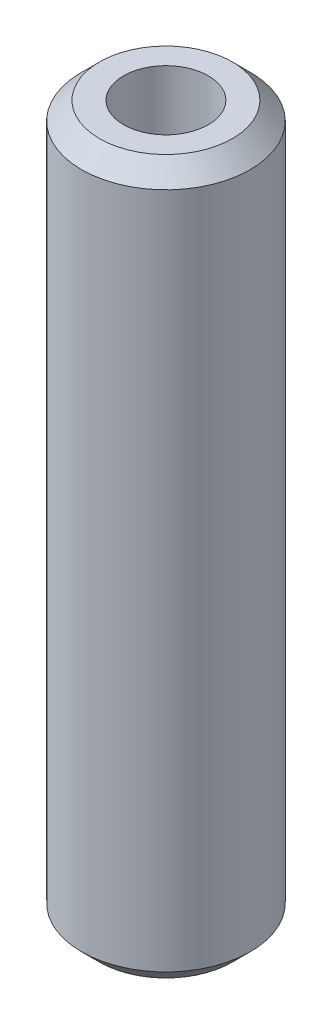
ISO-10303-21;
HEADER;
FILE_DESCRIPTION(('STEP AP214'),'2;1');
FILE_NAME('part.step','',(''),(''),'','','');
FILE_SCHEMA(('AUTOMOTIVE_DESIGN { 1 0 10303 214 1 1 1 1 }'));
ENDSEC;
DATA;
#1=APPLICATION_CONTEXT('core data for automotive mechanical design processes');
#2=APPLICATION_PROTOCOL_DEFINITION('international standard','automotive_design',2000,#1);
#3=PRODUCT_CONTEXT('',#1,'mechanical');
#4=PRODUCT('Part','Part','',(#3));
#5=PRODUCT_RELATED_PRODUCT_CATEGORY('part','',(#4));
#6=PRODUCT_DEFINITION_FORMATION('','',#4);
#7=PRODUCT_DEFINITION_CONTEXT('part definition',#1,'design');
#8=PRODUCT_DEFINITION('design','',#6,#7);
#9=PRODUCT_DEFINITION_SHAPE('','',#8);
#10=(LENGTH_UNIT() NAMED_UNIT(*) SI_UNIT(.MILLI.,.METRE.));
#11=(NAMED_UNIT(*) PLANE_ANGLE_UNIT() SI_UNIT($,.RADIAN.));
#12=(NAMED_UNIT(*) SI_UNIT($,.STERADIAN.) SOLID_ANGLE_UNIT());
#13=UNCERTAINTY_MEASURE_WITH_UNIT(LENGTH_MEASURE(1.E-05),#10,'distance_accuracy_value','');
#14=(GEOMETRIC_REPRESENTATION_CONTEXT(3) GLOBAL_UNCERTAINTY_ASSIGNED_CONTEXT((#13)) GLOBAL_UNIT_ASSIGNED_CONTEXT((#10,
#11,#12)) REPRESENTATION_CONTEXT('',''));
#15=CARTESIAN_POINT('',(0.,0.,0.));
#16=DIRECTION('',(0.,0.,1.));
#17=DIRECTION('',(1.,0.,0.));
#18=AXIS2_PLACEMENT_3D('',#15,#16,#17);
#19=CARTESIAN_POINT('',(0.,169.041992605061,0.));
#20=DIRECTION('',(0.,-1.,0.));
#21=DIRECTION('',(0.,0.,-1.));
#22=AXIS2_PLACEMENT_3D('',#19,#20,#21);
#23=CYLINDRICAL_SURFACE('',#22,20.);
#24=CARTESIAN_POINT('',(0.,164.795907385743,0.));
#25=DIRECTION('',(0.,1.,0.));
#26=DIRECTION('',(0.,0.,1.));
#27=AXIS2_PLACEMENT_3D('',#24,#25,#26);
#28=CIRCLE('',#27,20.);
#29=CARTESIAN_POINT('',(0.,164.795907385743,20.));
#30=VERTEX_POINT('',#29);
#31=EDGE_CURVE('E50',#30,#30,#28,.F.);
#32=ORIENTED_EDGE('',*,*,#31,.T.);
#33=EDGE_LOOP('',(#32));
#34=FACE_BOUND('',#33,.T.);
#35=CARTESIAN_POINT('',(0.,4.24608521931757,0.));
#36=DIRECTION('',(0.,1.,0.));
#37=DIRECTION('',(0.,0.,1.));
#38=AXIS2_PLACEMENT_3D('',#35,#36,#37);
#39=CIRCLE('',#38,20.);
#40=CARTESIAN_POINT('',(0.,4.24608521931757,20.));
#41=VERTEX_POINT('',#40);
#42=EDGE_CURVE('E51',#41,#41,#39,.T.);
#43=ORIENTED_EDGE('',*,*,#42,.T.);
#44=EDGE_LOOP('',(#43));
#45=FACE_BOUND('',#44,.T.);
#46=ADVANCED_FACE('F39',(#34,#45),#23,.T.);
#47=CARTESIAN_POINT('',(0.,169.041992605061,0.));
#48=DIRECTION('',(0.,1.,0.));
#49=DIRECTION('',(0.,0.,1.));
#50=AXIS2_PLACEMENT_3D('',#47,#48,#49);
#51=PLANE('',#50);
#52=CARTESIAN_POINT('',(0.,169.041992605061,0.));
#53=DIRECTION('',(0.,1.,0.));
#54=DIRECTION('',(0.,0.,1.));
#55=AXIS2_PLACEMENT_3D('',#52,#53,#54);
#56=CIRCLE('',#55,15.7539147806824);
#57=CARTESIAN_POINT('',(0.,169.041992605061,15.7539147806824));
#58=VERTEX_POINT('',#57);
#59=EDGE_CURVE('E54',#58,#58,#56,.T.);
#60=ORIENTED_EDGE('',*,*,#59,.T.);
#61=EDGE_LOOP('',(#60));
#62=FACE_BOUND('',#61,.T.);
#63=CARTESIAN_POINT('',(0.,169.041992605061,0.));
#64=DIRECTION('',(0.,1.,0.));
#65=DIRECTION('',(0.,0.,1.));
#66=AXIS2_PLACEMENT_3D('',#63,#64,#65);
#67=CIRCLE('',#66,10.0498066455622);
#68=CARTESIAN_POINT('',(0.,169.041992605061,10.0498066455622));
#69=VERTEX_POINT('',#68);
#70=EDGE_CURVE('E58',#69,#69,#67,.T.);
#71=ORIENTED_EDGE('',*,*,#70,.F.);
#72=EDGE_LOOP('',(#71));
#73=FACE_BOUND('',#72,.T.);
#74=ADVANCED_FACE('F69',(#62,#73),#51,.T.);
#75=CARTESIAN_POINT('',(0.,0.,0.));
#76=DIRECTION('',(0.,1.,0.));
#77=DIRECTION('',(0.,0.,1.));
#78=AXIS2_PLACEMENT_3D('',#75,#76,#77);
#79=PLANE('',#78);
#80=CARTESIAN_POINT('',(0.,0.,0.));
#81=DIRECTION('',(0.,1.,0.));
#82=DIRECTION('',(0.,0.,1.));
#83=AXIS2_PLACEMENT_3D('',#80,#81,#82);
#84=CIRCLE('',#83,15.7539147806824);
#85=CARTESIAN_POINT('',(0.,0.,15.7539147806824));
#86=VERTEX_POINT('',#85);
#87=EDGE_CURVE('E10',#86,#86,#84,.F.);
#88=ORIENTED_EDGE('',*,*,#87,.T.);
#89=EDGE_LOOP('',(#88));
#90=FACE_BOUND('',#89,.T.);
#91=CARTESIAN_POINT('',(0.,0.,0.));
#92=DIRECTION('',(0.,1.,0.));
#93=DIRECTION('',(0.,0.,1.));
#94=AXIS2_PLACEMENT_3D('',#91,#92,#93);
#95=CIRCLE('',#94,10.0498066455622);
#96=CARTESIAN_POINT('',(0.,0.,10.0498066455622));
#97=VERTEX_POINT('',#96);
#98=EDGE_CURVE('E63',#97,#97,#95,.T.);
#99=ORIENTED_EDGE('',*,*,#98,.T.);
#100=EDGE_LOOP('',(#99));
#101=FACE_BOUND('',#100,.T.);
#102=ADVANCED_FACE('F75',(#90,#101),#79,.F.);
#103=CARTESIAN_POINT('',(0.,169.041992605061,0.));
#104=DIRECTION('',(0.,-1.,0.));
#105=DIRECTION('',(0.,0.,-1.));
#106=AXIS2_PLACEMENT_3D('',#103,#104,#105);
#107=CYLINDRICAL_SURFACE('',#106,10.0498066455622);
#108=ORIENTED_EDGE('',*,*,#70,.T.);
#109=EDGE_LOOP('',(#108));
#110=FACE_BOUND('',#109,.T.);
#111=ORIENTED_EDGE('',*,*,#98,.F.);
#112=EDGE_LOOP('',(#111));
#113=FACE_BOUND('',#112,.T.);
#114=ADVANCED_FACE('F70',(#110,#113),#107,.F.);
#115=CARTESIAN_POINT('',(0.,169.041992605061,0.));
#116=DIRECTION('',(0.,-1.,0.));
#117=DIRECTION('',(0.,0.,-1.));
#118=AXIS2_PLACEMENT_3D('',#115,#116,#117);
#119=CONICAL_SURFACE('',#118,15.7539147806824,0.785398163397446);
#120=ORIENTED_EDGE('',*,*,#31,.F.);
#121=EDGE_LOOP('',(#120));
#122=FACE_BOUND('',#121,.T.);
#123=ORIENTED_EDGE('',*,*,#59,.F.);
#124=EDGE_LOOP('',(#123));
#125=FACE_BOUND('',#124,.T.);
#126=ADVANCED_FACE('F81',(#122,#125),#119,.T.);
#127=CARTESIAN_POINT('',(0.,4.24608521931757,0.));
#128=DIRECTION('',(0.,1.,0.));
#129=DIRECTION('',(0.,0.,1.));
#130=AXIS2_PLACEMENT_3D('',#127,#128,#129);
#131=CONICAL_SURFACE('',#130,20.,0.785398163397454);
#132=ORIENTED_EDGE('',*,*,#87,.F.);
#133=EDGE_LOOP('',(#132));
#134=FACE_BOUND('',#133,.T.);
#135=ORIENTED_EDGE('',*,*,#42,.F.);
#136=EDGE_LOOP('',(#135));
#137=FACE_BOUND('',#136,.T.);
#138=ADVANCED_FACE('F45',(#134,#137),#131,.T.);
#139=CLOSED_SHELL('',(#46,#74,#102,#114,#126,#138));
#140=MANIFOLD_SOLID_BREP('B2',#139);
#141=ADVANCED_BREP_SHAPE_REPRESENTATION('',(#18,#140),#14);
#142=SHAPE_DEFINITION_REPRESENTATION(#9,#141);
ENDSEC;
END-ISO-10303-21;
